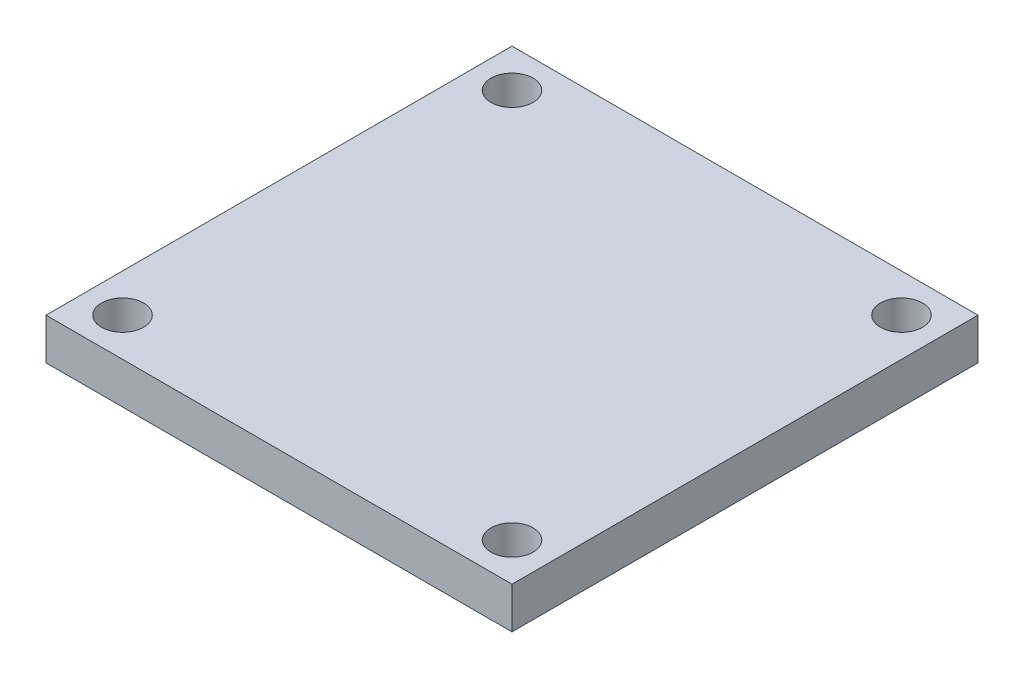
ISO-10303-21;
HEADER;
FILE_DESCRIPTION(('STEP AP214'),'2;1');
FILE_NAME('part.step','',(''),(''),'','','');
FILE_SCHEMA(('AUTOMOTIVE_DESIGN { 1 0 10303 214 1 1 1 1 }'));
ENDSEC;
DATA;
#1=APPLICATION_CONTEXT('core data for automotive mechanical design processes');
#2=APPLICATION_PROTOCOL_DEFINITION('international standard','automotive_design',2000,#1);
#3=PRODUCT_CONTEXT('',#1,'mechanical');
#4=PRODUCT('Part','Part','',(#3));
#5=PRODUCT_RELATED_PRODUCT_CATEGORY('part','',(#4));
#6=PRODUCT_DEFINITION_FORMATION('','',#4);
#7=PRODUCT_DEFINITION_CONTEXT('part definition',#1,'design');
#8=PRODUCT_DEFINITION('design','',#6,#7);
#9=PRODUCT_DEFINITION_SHAPE('','',#8);
#10=(LENGTH_UNIT() NAMED_UNIT(*) SI_UNIT(.MILLI.,.METRE.));
#11=(NAMED_UNIT(*) PLANE_ANGLE_UNIT() SI_UNIT($,.RADIAN.));
#12=(NAMED_UNIT(*) SI_UNIT($,.STERADIAN.) SOLID_ANGLE_UNIT());
#13=UNCERTAINTY_MEASURE_WITH_UNIT(LENGTH_MEASURE(1.E-05),#10,'distance_accuracy_value','');
#14=(GEOMETRIC_REPRESENTATION_CONTEXT(3) GLOBAL_UNCERTAINTY_ASSIGNED_CONTEXT((#13)) GLOBAL_UNIT_ASSIGNED_CONTEXT((#10,
#11,#12)) REPRESENTATION_CONTEXT('',''));
#15=CARTESIAN_POINT('',(0.,0.,0.));
#16=DIRECTION('',(0.,0.,1.));
#17=DIRECTION('',(1.,0.,0.));
#18=AXIS2_PLACEMENT_3D('',#15,#16,#17);
#19=CARTESIAN_POINT('',(0.,5.,0.));
#20=DIRECTION('',(0.,-1.,0.));
#21=DIRECTION('',(0.,0.,-1.));
#22=AXIS2_PLACEMENT_3D('',#19,#20,#21);
#23=PLANE('',#22);
#24=DIRECTION('',(0.,0.,-1.));
#25=VECTOR('',#24,1.);
#26=CARTESIAN_POINT('',(28.2,5.,28.2));
#27=LINE('',#26,#25);
#28=CARTESIAN_POINT('',(28.2,5.,28.2));
#29=VERTEX_POINT('',#28);
#30=CARTESIAN_POINT('',(28.2,5.,-28.2));
#31=VERTEX_POINT('',#30);
#32=EDGE_CURVE('E98',#29,#31,#27,.T.);
#33=ORIENTED_EDGE('',*,*,#32,.T.);
#34=DIRECTION('',(-1.,0.,0.));
#35=VECTOR('',#34,1.);
#36=CARTESIAN_POINT('',(-28.2,5.,-28.2));
#37=LINE('',#36,#35);
#38=CARTESIAN_POINT('',(-28.2,5.,-28.2));
#39=VERTEX_POINT('',#38);
#40=EDGE_CURVE('E93',#31,#39,#37,.T.);
#41=ORIENTED_EDGE('',*,*,#40,.T.);
#42=DIRECTION('',(0.,0.,1.));
#43=VECTOR('',#42,1.);
#44=CARTESIAN_POINT('',(-28.2,5.,28.2));
#45=LINE('',#44,#43);
#46=CARTESIAN_POINT('',(-28.2,5.,28.2));
#47=VERTEX_POINT('',#46);
#48=EDGE_CURVE('E96',#39,#47,#45,.T.);
#49=ORIENTED_EDGE('',*,*,#48,.T.);
#50=DIRECTION('',(1.,0.,0.));
#51=VECTOR('',#50,1.);
#52=CARTESIAN_POINT('',(-28.2,5.,28.2));
#53=LINE('',#52,#51);
#54=EDGE_CURVE('E63',#47,#29,#53,.T.);
#55=ORIENTED_EDGE('',*,*,#54,.T.);
#56=EDGE_LOOP('',(#33,#41,#49,#55));
#57=FACE_BOUND('',#56,.T.);
#58=CARTESIAN_POINT('',(-23.57,5.,23.57));
#59=DIRECTION('',(0.,1.,0.));
#60=DIRECTION('',(0.,0.,1.));
#61=AXIS2_PLACEMENT_3D('',#58,#59,#60);
#62=CIRCLE('',#61,2.55);
#63=CARTESIAN_POINT('',(-23.57,5.,26.12));
#64=VERTEX_POINT('',#63);
#65=EDGE_CURVE('E118',#64,#64,#62,.T.);
#66=ORIENTED_EDGE('',*,*,#65,.F.);
#67=EDGE_LOOP('',(#66));
#68=FACE_BOUND('',#67,.T.);
#69=CARTESIAN_POINT('',(23.57,5.,23.57));
#70=DIRECTION('',(0.,1.,0.));
#71=DIRECTION('',(0.,0.,-1.));
#72=AXIS2_PLACEMENT_3D('',#69,#70,#71);
#73=CIRCLE('',#72,2.55);
#74=CARTESIAN_POINT('',(23.57,5.,21.02));
#75=VERTEX_POINT('',#74);
#76=EDGE_CURVE('E140',#75,#75,#73,.T.);
#77=ORIENTED_EDGE('',*,*,#76,.F.);
#78=EDGE_LOOP('',(#77));
#79=FACE_BOUND('',#78,.T.);
#80=CARTESIAN_POINT('',(23.57,5.,-23.57));
#81=DIRECTION('',(0.,1.,0.));
#82=DIRECTION('',(0.,0.,1.));
#83=AXIS2_PLACEMENT_3D('',#80,#81,#82);
#84=CIRCLE('',#83,2.55);
#85=CARTESIAN_POINT('',(23.57,5.,-21.02));
#86=VERTEX_POINT('',#85);
#87=EDGE_CURVE('E148',#86,#86,#84,.T.);
#88=ORIENTED_EDGE('',*,*,#87,.F.);
#89=EDGE_LOOP('',(#88));
#90=FACE_BOUND('',#89,.T.);
#91=CARTESIAN_POINT('',(-23.57,5.,-23.57));
#92=DIRECTION('',(0.,1.,0.));
#93=DIRECTION('',(0.,0.,-1.));
#94=AXIS2_PLACEMENT_3D('',#91,#92,#93);
#95=CIRCLE('',#94,2.55);
#96=CARTESIAN_POINT('',(-23.57,5.,-26.12));
#97=VERTEX_POINT('',#96);
#98=EDGE_CURVE('E156',#97,#97,#95,.T.);
#99=ORIENTED_EDGE('',*,*,#98,.F.);
#100=EDGE_LOOP('',(#99));
#101=FACE_BOUND('',#100,.T.);
#102=ADVANCED_FACE('F45',(#57,#68,#79,#90,#101),#23,.F.);
#103=CARTESIAN_POINT('',(0.,0.,0.));
#104=DIRECTION('',(0.,-1.,0.));
#105=DIRECTION('',(0.,0.,-1.));
#106=AXIS2_PLACEMENT_3D('',#103,#104,#105);
#107=PLANE('',#106);
#108=CARTESIAN_POINT('',(23.57,0.,-23.57));
#109=DIRECTION('',(0.,1.,0.));
#110=DIRECTION('',(0.,0.,1.));
#111=AXIS2_PLACEMENT_3D('',#108,#109,#110);
#112=CIRCLE('',#111,2.55);
#113=CARTESIAN_POINT('',(23.57,0.,-21.02));
#114=VERTEX_POINT('',#113);
#115=EDGE_CURVE('E152',#114,#114,#112,.T.);
#116=ORIENTED_EDGE('',*,*,#115,.T.);
#117=EDGE_LOOP('',(#116));
#118=FACE_BOUND('',#117,.T.);
#119=CARTESIAN_POINT('',(-23.57,0.,23.57));
#120=DIRECTION('',(0.,1.,0.));
#121=DIRECTION('',(0.,0.,1.));
#122=AXIS2_PLACEMENT_3D('',#119,#120,#121);
#123=CIRCLE('',#122,2.55);
#124=CARTESIAN_POINT('',(-23.57,0.,26.12));
#125=VERTEX_POINT('',#124);
#126=EDGE_CURVE('E136',#125,#125,#123,.T.);
#127=ORIENTED_EDGE('',*,*,#126,.T.);
#128=EDGE_LOOP('',(#127));
#129=FACE_BOUND('',#128,.T.);
#130=DIRECTION('',(0.,0.,-1.));
#131=VECTOR('',#130,1.);
#132=CARTESIAN_POINT('',(28.2,0.,28.2));
#133=LINE('',#132,#131);
#134=CARTESIAN_POINT('',(28.2,0.,28.2));
#135=VERTEX_POINT('',#134);
#136=CARTESIAN_POINT('',(28.2,0.,-28.2));
#137=VERTEX_POINT('',#136);
#138=EDGE_CURVE('E114',#135,#137,#133,.T.);
#139=ORIENTED_EDGE('',*,*,#138,.F.);
#140=DIRECTION('',(1.,0.,0.));
#141=VECTOR('',#140,1.);
#142=CARTESIAN_POINT('',(-28.2,0.,28.2));
#143=LINE('',#142,#141);
#144=CARTESIAN_POINT('',(-28.2,0.,28.2));
#145=VERTEX_POINT('',#144);
#146=EDGE_CURVE('E86',#145,#135,#143,.T.);
#147=ORIENTED_EDGE('',*,*,#146,.F.);
#148=DIRECTION('',(0.,0.,1.));
#149=VECTOR('',#148,1.);
#150=CARTESIAN_POINT('',(-28.2,0.,28.2));
#151=LINE('',#150,#149);
#152=CARTESIAN_POINT('',(-28.2,0.,-28.2));
#153=VERTEX_POINT('',#152);
#154=EDGE_CURVE('E80',#153,#145,#151,.T.);
#155=ORIENTED_EDGE('',*,*,#154,.F.);
#156=DIRECTION('',(-1.,0.,0.));
#157=VECTOR('',#156,1.);
#158=CARTESIAN_POINT('',(-28.2,0.,-28.2));
#159=LINE('',#158,#157);
#160=EDGE_CURVE('E103',#137,#153,#159,.T.);
#161=ORIENTED_EDGE('',*,*,#160,.F.);
#162=EDGE_LOOP('',(#139,#147,#155,#161));
#163=FACE_BOUND('',#162,.T.);
#164=CARTESIAN_POINT('',(23.57,0.,23.57));
#165=DIRECTION('',(0.,1.,0.));
#166=DIRECTION('',(0.,0.,-1.));
#167=AXIS2_PLACEMENT_3D('',#164,#165,#166);
#168=CIRCLE('',#167,2.55);
#169=CARTESIAN_POINT('',(23.57,0.,21.02));
#170=VERTEX_POINT('',#169);
#171=EDGE_CURVE('E144',#170,#170,#168,.T.);
#172=ORIENTED_EDGE('',*,*,#171,.T.);
#173=EDGE_LOOP('',(#172));
#174=FACE_BOUND('',#173,.T.);
#175=CARTESIAN_POINT('',(-23.57,0.,-23.57));
#176=DIRECTION('',(0.,1.,0.));
#177=DIRECTION('',(0.,0.,-1.));
#178=AXIS2_PLACEMENT_3D('',#175,#176,#177);
#179=CIRCLE('',#178,2.55);
#180=CARTESIAN_POINT('',(-23.57,0.,-26.12));
#181=VERTEX_POINT('',#180);
#182=EDGE_CURVE('E160',#181,#181,#179,.T.);
#183=ORIENTED_EDGE('',*,*,#182,.T.);
#184=EDGE_LOOP('',(#183));
#185=FACE_BOUND('',#184,.T.);
#186=ADVANCED_FACE('F131',(#118,#129,#163,#174,#185),#107,.T.);
#187=CARTESIAN_POINT('',(28.2,5.,28.2));
#188=DIRECTION('',(-1.,0.,0.));
#189=DIRECTION('',(0.,0.,1.));
#190=AXIS2_PLACEMENT_3D('',#187,#188,#189);
#191=PLANE('',#190);
#192=ORIENTED_EDGE('',*,*,#138,.T.);
#193=DIRECTION('',(0.,-1.,0.));
#194=VECTOR('',#193,1.);
#195=CARTESIAN_POINT('',(28.2,5.,-28.2));
#196=LINE('',#195,#194);
#197=EDGE_CURVE('E11',#31,#137,#196,.T.);
#198=ORIENTED_EDGE('',*,*,#197,.F.);
#199=ORIENTED_EDGE('',*,*,#32,.F.);
#200=DIRECTION('',(0.,-1.,0.));
#201=VECTOR('',#200,1.);
#202=CARTESIAN_POINT('',(28.2,5.,28.2));
#203=LINE('',#202,#201);
#204=EDGE_CURVE('E110',#29,#135,#203,.T.);
#205=ORIENTED_EDGE('',*,*,#204,.T.);
#206=EDGE_LOOP('',(#192,#198,#199,#205));
#207=FACE_BOUND('',#206,.T.);
#208=ADVANCED_FACE('F47',(#207),#191,.F.);
#209=CARTESIAN_POINT('',(-28.2,5.,-28.2));
#210=DIRECTION('',(0.,0.,1.));
#211=DIRECTION('',(1.,0.,0.));
#212=AXIS2_PLACEMENT_3D('',#209,#210,#211);
#213=PLANE('',#212);
#214=ORIENTED_EDGE('',*,*,#160,.T.);
#215=DIRECTION('',(0.,-1.,0.));
#216=VECTOR('',#215,1.);
#217=CARTESIAN_POINT('',(-28.2,5.,-28.2));
#218=LINE('',#217,#216);
#219=EDGE_CURVE('E55',#39,#153,#218,.T.);
#220=ORIENTED_EDGE('',*,*,#219,.F.);
#221=ORIENTED_EDGE('',*,*,#40,.F.);
#222=ORIENTED_EDGE('',*,*,#197,.T.);
#223=EDGE_LOOP('',(#214,#220,#221,#222));
#224=FACE_BOUND('',#223,.T.);
#225=ADVANCED_FACE('F102',(#224),#213,.F.);
#226=CARTESIAN_POINT('',(-28.2,5.,28.2));
#227=DIRECTION('',(1.,0.,0.));
#228=DIRECTION('',(0.,0.,-1.));
#229=AXIS2_PLACEMENT_3D('',#226,#227,#228);
#230=PLANE('',#229);
#231=ORIENTED_EDGE('',*,*,#154,.T.);
#232=DIRECTION('',(0.,-1.,0.));
#233=VECTOR('',#232,1.);
#234=CARTESIAN_POINT('',(-28.2,5.,28.2));
#235=LINE('',#234,#233);
#236=EDGE_CURVE('E105',#47,#145,#235,.T.);
#237=ORIENTED_EDGE('',*,*,#236,.F.);
#238=ORIENTED_EDGE('',*,*,#48,.F.);
#239=ORIENTED_EDGE('',*,*,#219,.T.);
#240=EDGE_LOOP('',(#231,#237,#238,#239));
#241=FACE_BOUND('',#240,.T.);
#242=ADVANCED_FACE('F106',(#241),#230,.F.);
#243=CARTESIAN_POINT('',(-28.2,5.,28.2));
#244=DIRECTION('',(0.,0.,-1.));
#245=DIRECTION('',(-1.,0.,0.));
#246=AXIS2_PLACEMENT_3D('',#243,#244,#245);
#247=PLANE('',#246);
#248=ORIENTED_EDGE('',*,*,#146,.T.);
#249=ORIENTED_EDGE('',*,*,#204,.F.);
#250=ORIENTED_EDGE('',*,*,#54,.F.);
#251=ORIENTED_EDGE('',*,*,#236,.T.);
#252=EDGE_LOOP('',(#248,#249,#250,#251));
#253=FACE_BOUND('',#252,.T.);
#254=ADVANCED_FACE('F128',(#253),#247,.F.);
#255=CARTESIAN_POINT('',(-23.57,5.,23.57));
#256=DIRECTION('',(0.,-1.,0.));
#257=DIRECTION('',(0.,0.,-1.));
#258=AXIS2_PLACEMENT_3D('',#255,#256,#257);
#259=CYLINDRICAL_SURFACE('',#258,2.55);
#260=ORIENTED_EDGE('',*,*,#65,.T.);
#261=EDGE_LOOP('',(#260));
#262=FACE_BOUND('',#261,.T.);
#263=ORIENTED_EDGE('',*,*,#126,.F.);
#264=EDGE_LOOP('',(#263));
#265=FACE_BOUND('',#264,.T.);
#266=ADVANCED_FACE('F179',(#262,#265),#259,.F.);
#267=CARTESIAN_POINT('',(23.57,5.,23.57));
#268=DIRECTION('',(0.,-1.,0.));
#269=DIRECTION('',(0.,0.,-1.));
#270=AXIS2_PLACEMENT_3D('',#267,#268,#269);
#271=CYLINDRICAL_SURFACE('',#270,2.55);
#272=ORIENTED_EDGE('',*,*,#76,.T.);
#273=EDGE_LOOP('',(#272));
#274=FACE_BOUND('',#273,.T.);
#275=ORIENTED_EDGE('',*,*,#171,.F.);
#276=EDGE_LOOP('',(#275));
#277=FACE_BOUND('',#276,.T.);
#278=ADVANCED_FACE('F224',(#274,#277),#271,.F.);
#279=CARTESIAN_POINT('',(23.57,5.,-23.57));
#280=DIRECTION('',(0.,-1.,0.));
#281=DIRECTION('',(0.,0.,-1.));
#282=AXIS2_PLACEMENT_3D('',#279,#280,#281);
#283=CYLINDRICAL_SURFACE('',#282,2.55);
#284=ORIENTED_EDGE('',*,*,#87,.T.);
#285=EDGE_LOOP('',(#284));
#286=FACE_BOUND('',#285,.T.);
#287=ORIENTED_EDGE('',*,*,#115,.F.);
#288=EDGE_LOOP('',(#287));
#289=FACE_BOUND('',#288,.T.);
#290=ADVANCED_FACE('F232',(#286,#289),#283,.F.);
#291=CARTESIAN_POINT('',(-23.57,5.,-23.57));
#292=DIRECTION('',(0.,-1.,0.));
#293=DIRECTION('',(0.,0.,-1.));
#294=AXIS2_PLACEMENT_3D('',#291,#292,#293);
#295=CYLINDRICAL_SURFACE('',#294,2.55);
#296=ORIENTED_EDGE('',*,*,#98,.T.);
#297=EDGE_LOOP('',(#296));
#298=FACE_BOUND('',#297,.T.);
#299=ORIENTED_EDGE('',*,*,#182,.F.);
#300=EDGE_LOOP('',(#299));
#301=FACE_BOUND('',#300,.T.);
#302=ADVANCED_FACE('F168',(#298,#301),#295,.F.);
#303=CLOSED_SHELL('',(#102,#186,#208,#225,#242,#254,#266,#278,#290,#302));
#304=MANIFOLD_SOLID_BREP('B2',#303);
#305=ADVANCED_BREP_SHAPE_REPRESENTATION('',(#18,#304),#14);
#306=SHAPE_DEFINITION_REPRESENTATION(#9,#305);
ENDSEC;
END-ISO-10303-21;
